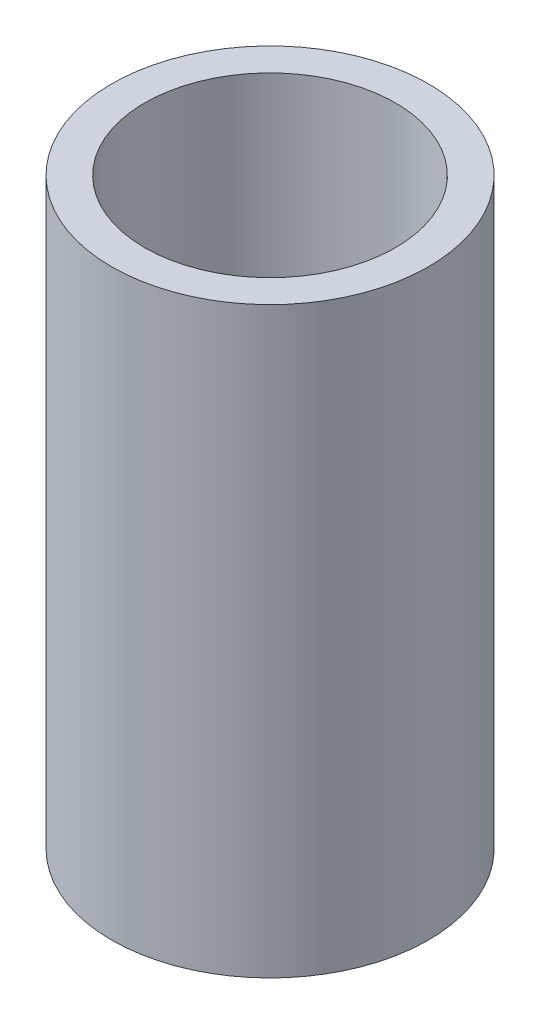
ISO-10303-21;
HEADER;
FILE_DESCRIPTION(('STEP AP214'),'2;1');
FILE_NAME('part.step','',(''),(''),'','','');
FILE_SCHEMA(('AUTOMOTIVE_DESIGN { 1 0 10303 214 1 1 1 1 }'));
ENDSEC;
DATA;
#1=APPLICATION_CONTEXT('core data for automotive mechanical design processes');
#2=APPLICATION_PROTOCOL_DEFINITION('international standard','automotive_design',2000,#1);
#3=PRODUCT_CONTEXT('',#1,'mechanical');
#4=PRODUCT('Part','Part','',(#3));
#5=PRODUCT_RELATED_PRODUCT_CATEGORY('part','',(#4));
#6=PRODUCT_DEFINITION_FORMATION('','',#4);
#7=PRODUCT_DEFINITION_CONTEXT('part definition',#1,'design');
#8=PRODUCT_DEFINITION('design','',#6,#7);
#9=PRODUCT_DEFINITION_SHAPE('','',#8);
#10=(LENGTH_UNIT() NAMED_UNIT(*) SI_UNIT(.MILLI.,.METRE.));
#11=(NAMED_UNIT(*) PLANE_ANGLE_UNIT() SI_UNIT($,.RADIAN.));
#12=(NAMED_UNIT(*) SI_UNIT($,.STERADIAN.) SOLID_ANGLE_UNIT());
#13=UNCERTAINTY_MEASURE_WITH_UNIT(LENGTH_MEASURE(1.E-05),#10,'distance_accuracy_value','');
#14=(GEOMETRIC_REPRESENTATION_CONTEXT(3) GLOBAL_UNCERTAINTY_ASSIGNED_CONTEXT((#13)) GLOBAL_UNIT_ASSIGNED_CONTEXT((#10,
#11,#12)) REPRESENTATION_CONTEXT('',''));
#15=CARTESIAN_POINT('',(0.,0.,0.));
#16=DIRECTION('',(0.,0.,1.));
#17=DIRECTION('',(1.,0.,0.));
#18=AXIS2_PLACEMENT_3D('',#15,#16,#17);
#19=CARTESIAN_POINT('',(0.,73.6157413500718,0.));
#20=DIRECTION('',(0.,-1.,0.));
#21=DIRECTION('',(0.,0.,-1.));
#22=AXIS2_PLACEMENT_3D('',#19,#20,#21);
#23=CYLINDRICAL_SURFACE('',#22,20.);
#24=CARTESIAN_POINT('',(0.,73.6157413500718,0.));
#25=DIRECTION('',(0.,1.,0.));
#26=DIRECTION('',(0.,0.,1.));
#27=AXIS2_PLACEMENT_3D('',#24,#25,#26);
#28=CIRCLE('',#27,20.);
#29=CARTESIAN_POINT('',(0.,73.6157413500718,20.));
#30=VERTEX_POINT('',#29);
#31=EDGE_CURVE('E10',#30,#30,#28,.T.);
#32=ORIENTED_EDGE('',*,*,#31,.F.);
#33=EDGE_LOOP('',(#32));
#34=FACE_BOUND('',#33,.T.);
#35=CARTESIAN_POINT('',(0.,0.,0.));
#36=DIRECTION('',(0.,1.,0.));
#37=DIRECTION('',(0.,0.,1.));
#38=AXIS2_PLACEMENT_3D('',#35,#36,#37);
#39=CIRCLE('',#38,20.);
#40=CARTESIAN_POINT('',(0.,0.,20.));
#41=VERTEX_POINT('',#40);
#42=EDGE_CURVE('E37',#41,#41,#39,.T.);
#43=ORIENTED_EDGE('',*,*,#42,.T.);
#44=EDGE_LOOP('',(#43));
#45=FACE_BOUND('',#44,.T.);
#46=ADVANCED_FACE('F40',(#34,#45),#23,.T.);
#47=CARTESIAN_POINT('',(0.,73.6157413500718,0.));
#48=DIRECTION('',(0.,1.,0.));
#49=DIRECTION('',(0.,0.,1.));
#50=AXIS2_PLACEMENT_3D('',#47,#48,#49);
#51=PLANE('',#50);
#52=CARTESIAN_POINT('',(0.,73.6157413500718,0.));
#53=DIRECTION('',(0.,1.,0.));
#54=DIRECTION('',(0.,0.,1.));
#55=AXIS2_PLACEMENT_3D('',#52,#53,#54);
#56=CIRCLE('',#55,15.8328654930501);
#57=CARTESIAN_POINT('',(0.,73.6157413500718,15.8328654930501));
#58=VERTEX_POINT('',#57);
#59=EDGE_CURVE('E50',#58,#58,#56,.T.);
#60=ORIENTED_EDGE('',*,*,#59,.F.);
#61=EDGE_LOOP('',(#60));
#62=FACE_BOUND('',#61,.T.);
#63=ORIENTED_EDGE('',*,*,#31,.T.);
#64=EDGE_LOOP('',(#63));
#65=FACE_BOUND('',#64,.T.);
#66=ADVANCED_FACE('F59',(#62,#65),#51,.T.);
#67=CARTESIAN_POINT('',(0.,0.,0.));
#68=DIRECTION('',(0.,1.,0.));
#69=DIRECTION('',(0.,0.,1.));
#70=AXIS2_PLACEMENT_3D('',#67,#68,#69);
#71=PLANE('',#70);
#72=CARTESIAN_POINT('',(0.,0.,0.));
#73=DIRECTION('',(0.,1.,0.));
#74=DIRECTION('',(0.,0.,1.));
#75=AXIS2_PLACEMENT_3D('',#72,#73,#74);
#76=CIRCLE('',#75,15.8328654930501);
#77=CARTESIAN_POINT('',(0.,0.,15.8328654930501));
#78=VERTEX_POINT('',#77);
#79=EDGE_CURVE('E47',#78,#78,#76,.T.);
#80=ORIENTED_EDGE('',*,*,#79,.T.);
#81=EDGE_LOOP('',(#80));
#82=FACE_BOUND('',#81,.T.);
#83=ORIENTED_EDGE('',*,*,#42,.F.);
#84=EDGE_LOOP('',(#83));
#85=FACE_BOUND('',#84,.T.);
#86=ADVANCED_FACE('F58',(#82,#85),#71,.F.);
#87=CARTESIAN_POINT('',(0.,73.6157413500718,0.));
#88=DIRECTION('',(0.,-1.,0.));
#89=DIRECTION('',(0.,0.,-1.));
#90=AXIS2_PLACEMENT_3D('',#87,#88,#89);
#91=CYLINDRICAL_SURFACE('',#90,15.8328654930501);
#92=ORIENTED_EDGE('',*,*,#59,.T.);
#93=EDGE_LOOP('',(#92));
#94=FACE_BOUND('',#93,.T.);
#95=ORIENTED_EDGE('',*,*,#79,.F.);
#96=EDGE_LOOP('',(#95));
#97=FACE_BOUND('',#96,.T.);
#98=ADVANCED_FACE('F54',(#94,#97),#91,.F.);
#99=CLOSED_SHELL('',(#46,#66,#86,#98));
#100=MANIFOLD_SOLID_BREP('B2',#99);
#101=ADVANCED_BREP_SHAPE_REPRESENTATION('',(#18,#100),#14);
#102=SHAPE_DEFINITION_REPRESENTATION(#9,#101);
ENDSEC;
END-ISO-10303-21;
